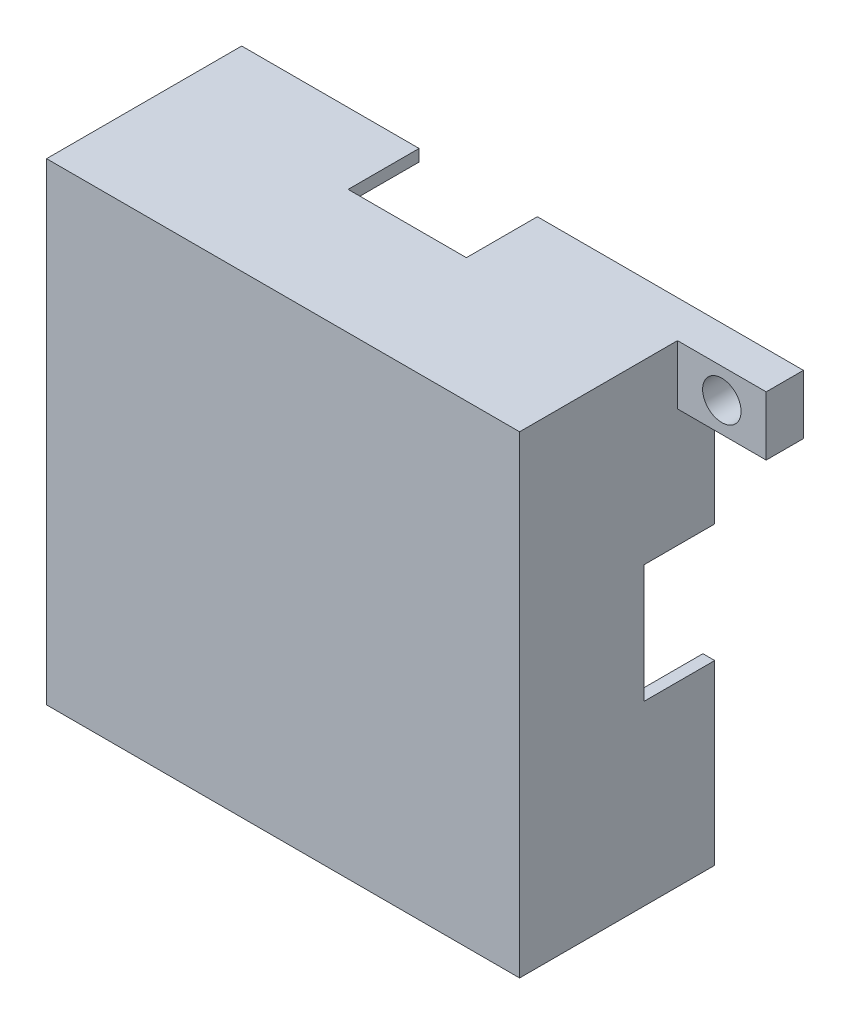
ISO-10303-21;
HEADER;
FILE_DESCRIPTION(('STEP AP214'),'2;1');
FILE_NAME('part.step','',(''),(''),'','','');
FILE_SCHEMA(('AUTOMOTIVE_DESIGN { 1 0 10303 214 1 1 1 1 }'));
ENDSEC;
DATA;
#1=APPLICATION_CONTEXT('core data for automotive mechanical design processes');
#2=APPLICATION_PROTOCOL_DEFINITION('international standard','automotive_design',2000,#1);
#3=PRODUCT_CONTEXT('',#1,'mechanical');
#4=PRODUCT('Part','Part','',(#3));
#5=PRODUCT_RELATED_PRODUCT_CATEGORY('part','',(#4));
#6=PRODUCT_DEFINITION_FORMATION('','',#4);
#7=PRODUCT_DEFINITION_CONTEXT('part definition',#1,'design');
#8=PRODUCT_DEFINITION('design','',#6,#7);
#9=PRODUCT_DEFINITION_SHAPE('','',#8);
#10=(LENGTH_UNIT() NAMED_UNIT(*) SI_UNIT(.MILLI.,.METRE.));
#11=(NAMED_UNIT(*) PLANE_ANGLE_UNIT() SI_UNIT($,.RADIAN.));
#12=(NAMED_UNIT(*) SI_UNIT($,.STERADIAN.) SOLID_ANGLE_UNIT());
#13=UNCERTAINTY_MEASURE_WITH_UNIT(LENGTH_MEASURE(1.E-05),#10,'distance_accuracy_value','');
#14=(GEOMETRIC_REPRESENTATION_CONTEXT(3) GLOBAL_UNCERTAINTY_ASSIGNED_CONTEXT((#13)) GLOBAL_UNIT_ASSIGNED_CONTEXT((#10,
#11,#12)) REPRESENTATION_CONTEXT('',''));
#15=CARTESIAN_POINT('',(0.,0.,0.));
#16=DIRECTION('',(0.,0.,1.));
#17=DIRECTION('',(1.,0.,0.));
#18=AXIS2_PLACEMENT_3D('',#15,#16,#17);
#19=CARTESIAN_POINT('',(0.,0.,0.));
#20=DIRECTION('',(0.,0.,-1.));
#21=DIRECTION('',(-1.,0.,0.));
#22=AXIS2_PLACEMENT_3D('',#19,#20,#21);
#23=PLANE('',#22);
#24=DIRECTION('',(-1.,0.,0.));
#25=VECTOR('',#24,1.);
#26=CARTESIAN_POINT('',(0.,40.,0.));
#27=LINE('',#26,#25);
#28=CARTESIAN_POINT('',(15.,40.,0.));
#29=VERTEX_POINT('',#28);
#30=CARTESIAN_POINT('',(0.,40.,0.));
#31=VERTEX_POINT('',#30);
#32=EDGE_CURVE('E377',#29,#31,#27,.T.);
#33=ORIENTED_EDGE('',*,*,#32,.F.);
#34=DIRECTION('',(0.,-1.,0.));
#35=VECTOR('',#34,1.);
#36=CARTESIAN_POINT('',(15.,40.,0.));
#37=LINE('',#36,#35);
#38=CARTESIAN_POINT('',(15.,39.,0.));
#39=VERTEX_POINT('',#38);
#40=EDGE_CURVE('E91',#29,#39,#37,.T.);
#41=ORIENTED_EDGE('',*,*,#40,.T.);
#42=DIRECTION('',(-1.,0.,0.));
#43=VECTOR('',#42,1.);
#44=CARTESIAN_POINT('',(1.,39.,0.));
#45=LINE('',#44,#43);
#46=CARTESIAN_POINT('',(1.,39.,0.));
#47=VERTEX_POINT('',#46);
#48=EDGE_CURVE('E360',#39,#47,#45,.T.);
#49=ORIENTED_EDGE('',*,*,#48,.T.);
#50=DIRECTION('',(0.,-1.,0.));
#51=VECTOR('',#50,1.);
#52=CARTESIAN_POINT('',(1.,1.,0.));
#53=LINE('',#52,#51);
#54=CARTESIAN_POINT('',(1.,25.,0.));
#55=VERTEX_POINT('',#54);
#56=EDGE_CURVE('E349',#47,#55,#53,.T.);
#57=ORIENTED_EDGE('',*,*,#56,.T.);
#58=DIRECTION('',(-1.,0.,0.));
#59=VECTOR('',#58,1.);
#60=CARTESIAN_POINT('',(47.5,25.,0.));
#61=LINE('',#60,#59);
#62=CARTESIAN_POINT('',(0.,25.,0.));
#63=VERTEX_POINT('',#62);
#64=EDGE_CURVE('E394',#55,#63,#61,.T.);
#65=ORIENTED_EDGE('',*,*,#64,.T.);
#66=DIRECTION('',(0.,1.,0.));
#67=VECTOR('',#66,1.);
#68=CARTESIAN_POINT('',(0.,0.,0.));
#69=LINE('',#68,#67);
#70=EDGE_CURVE('E113',#31,#63,#69,.F.);
#71=ORIENTED_EDGE('',*,*,#70,.F.);
#72=EDGE_LOOP('',(#33,#41,#49,#57,#65,#71));
#73=FACE_BOUND('',#72,.T.);
#74=ADVANCED_FACE('F41',(#73),#23,.T.);
#75=DIRECTION('',(1.,0.,0.));
#76=VECTOR('',#75,1.);
#77=CARTESIAN_POINT('',(1.,1.,0.));
#78=LINE('',#77,#76);
#79=CARTESIAN_POINT('',(1.,1.,0.));
#80=VERTEX_POINT('',#79);
#81=CARTESIAN_POINT('',(15.,1.,0.));
#82=VERTEX_POINT('',#81);
#83=EDGE_CURVE('E162',#80,#82,#78,.T.);
#84=ORIENTED_EDGE('',*,*,#83,.T.);
#85=CARTESIAN_POINT('',(15.,0.,0.));
#86=VERTEX_POINT('',#85);
#87=EDGE_CURVE('E151',#82,#86,#37,.T.);
#88=ORIENTED_EDGE('',*,*,#87,.T.);
#89=DIRECTION('',(1.,0.,0.));
#90=VECTOR('',#89,1.);
#91=CARTESIAN_POINT('',(0.,0.,0.));
#92=LINE('',#91,#90);
#93=CARTESIAN_POINT('',(0.,0.,0.));
#94=VERTEX_POINT('',#93);
#95=EDGE_CURVE('E115',#94,#86,#92,.T.);
#96=ORIENTED_EDGE('',*,*,#95,.F.);
#97=DIRECTION('',(0.,1.,0.));
#98=VECTOR('',#97,1.);
#99=CARTESIAN_POINT('',(0.,0.,0.));
#100=LINE('',#99,#98);
#101=CARTESIAN_POINT('',(0.,15.,0.));
#102=VERTEX_POINT('',#101);
#103=EDGE_CURVE('E120',#102,#94,#100,.F.);
#104=ORIENTED_EDGE('',*,*,#103,.F.);
#105=DIRECTION('',(-1.,0.,0.));
#106=VECTOR('',#105,1.);
#107=CARTESIAN_POINT('',(47.5,15.,0.));
#108=LINE('',#107,#106);
#109=CARTESIAN_POINT('',(1.,15.,0.));
#110=VERTEX_POINT('',#109);
#111=EDGE_CURVE('E238',#110,#102,#108,.T.);
#112=ORIENTED_EDGE('',*,*,#111,.F.);
#113=EDGE_CURVE('E331',#110,#80,#53,.T.);
#114=ORIENTED_EDGE('',*,*,#113,.T.);
#115=EDGE_LOOP('',(#84,#88,#96,#104,#112,#114));
#116=FACE_BOUND('',#115,.T.);
#117=ADVANCED_FACE('F157',(#116),#23,.T.);
#118=CARTESIAN_POINT('',(0.,0.,15.));
#119=DIRECTION('',(0.,1.,0.));
#120=DIRECTION('',(0.,0.,1.));
#121=AXIS2_PLACEMENT_3D('',#118,#119,#120);
#122=PLANE('',#121);
#123=DIRECTION('',(0.,0.,-1.));
#124=VECTOR('',#123,1.);
#125=CARTESIAN_POINT('',(15.,0.,0.));
#126=LINE('',#125,#124);
#127=CARTESIAN_POINT('',(15.,0.,6.));
#128=VERTEX_POINT('',#127);
#129=EDGE_CURVE('E102',#128,#86,#126,.T.);
#130=ORIENTED_EDGE('',*,*,#129,.F.);
#131=DIRECTION('',(-1.,0.,0.));
#132=VECTOR('',#131,1.);
#133=CARTESIAN_POINT('',(15.,0.,6.));
#134=LINE('',#133,#132);
#135=CARTESIAN_POINT('',(25.,0.,6.));
#136=VERTEX_POINT('',#135);
#137=EDGE_CURVE('E104',#136,#128,#134,.T.);
#138=ORIENTED_EDGE('',*,*,#137,.F.);
#139=DIRECTION('',(0.,0.,1.));
#140=VECTOR('',#139,1.);
#141=CARTESIAN_POINT('',(25.,0.,0.));
#142=LINE('',#141,#140);
#143=CARTESIAN_POINT('',(25.,0.,0.));
#144=VERTEX_POINT('',#143);
#145=EDGE_CURVE('E83',#144,#136,#142,.T.);
#146=ORIENTED_EDGE('',*,*,#145,.F.);
#147=DIRECTION('',(1.,0.,0.));
#148=VECTOR('',#147,1.);
#149=CARTESIAN_POINT('',(0.,0.,0.));
#150=LINE('',#149,#148);
#151=CARTESIAN_POINT('',(40.,0.,0.));
#152=VERTEX_POINT('',#151);
#153=EDGE_CURVE('E44',#144,#152,#150,.T.);
#154=ORIENTED_EDGE('',*,*,#153,.T.);
#155=DIRECTION('',(0.,0.,-1.));
#156=VECTOR('',#155,1.);
#157=CARTESIAN_POINT('',(40.,0.,15.));
#158=LINE('',#157,#156);
#159=CARTESIAN_POINT('',(40.,0.,16.5));
#160=VERTEX_POINT('',#159);
#161=EDGE_CURVE('E133',#160,#152,#158,.T.);
#162=ORIENTED_EDGE('',*,*,#161,.F.);
#163=DIRECTION('',(1.,0.,0.));
#164=VECTOR('',#163,1.);
#165=CARTESIAN_POINT('',(0.,0.,16.5));
#166=LINE('',#165,#164);
#167=CARTESIAN_POINT('',(0.,0.,16.5));
#168=VERTEX_POINT('',#167);
#169=EDGE_CURVE('E169',#168,#160,#166,.T.);
#170=ORIENTED_EDGE('',*,*,#169,.F.);
#171=DIRECTION('',(0.,0.,-1.));
#172=VECTOR('',#171,1.);
#173=CARTESIAN_POINT('',(0.,0.,15.));
#174=LINE('',#173,#172);
#175=EDGE_CURVE('E128',#168,#94,#174,.T.);
#176=ORIENTED_EDGE('',*,*,#175,.T.);
#177=ORIENTED_EDGE('',*,*,#95,.T.);
#178=EDGE_LOOP('',(#130,#138,#146,#154,#162,#170,#176,#177));
#179=FACE_BOUND('',#178,.T.);
#180=ADVANCED_FACE('F99',(#179),#122,.F.);
#181=DIRECTION('',(0.,-1.,0.));
#182=VECTOR('',#181,1.);
#183=CARTESIAN_POINT('',(25.,40.,0.));
#184=LINE('',#183,#182);
#185=CARTESIAN_POINT('',(25.,40.,0.));
#186=VERTEX_POINT('',#185);
#187=CARTESIAN_POINT('',(25.,39.,0.));
#188=VERTEX_POINT('',#187);
#189=EDGE_CURVE('E95',#186,#188,#184,.T.);
#190=ORIENTED_EDGE('',*,*,#189,.F.);
#191=CARTESIAN_POINT('',(47.5,40.,0.));
#192=VERTEX_POINT('',#191);
#193=EDGE_CURVE('E374',#192,#186,#27,.T.);
#194=ORIENTED_EDGE('',*,*,#193,.F.);
#195=DIRECTION('',(0.,-1.,0.));
#196=VECTOR('',#195,1.);
#197=CARTESIAN_POINT('',(47.5,40.,0.));
#198=LINE('',#197,#196);
#199=CARTESIAN_POINT('',(47.5,35.,0.));
#200=VERTEX_POINT('',#199);
#201=EDGE_CURVE('E313',#192,#200,#198,.T.);
#202=ORIENTED_EDGE('',*,*,#201,.T.);
#203=DIRECTION('',(-1.,0.,0.));
#204=VECTOR('',#203,1.);
#205=CARTESIAN_POINT('',(40.,35.,0.));
#206=LINE('',#205,#204);
#207=CARTESIAN_POINT('',(40.,35.,0.));
#208=VERTEX_POINT('',#207);
#209=EDGE_CURVE('E310',#200,#208,#206,.T.);
#210=ORIENTED_EDGE('',*,*,#209,.T.);
#211=DIRECTION('',(0.,1.,0.));
#212=VECTOR('',#211,1.);
#213=CARTESIAN_POINT('',(40.,0.,0.));
#214=LINE('',#213,#212);
#215=CARTESIAN_POINT('',(40.,25.,0.));
#216=VERTEX_POINT('',#215);
#217=EDGE_CURVE('E114',#216,#208,#214,.T.);
#218=ORIENTED_EDGE('',*,*,#217,.F.);
#219=CARTESIAN_POINT('',(39.,25.,0.));
#220=VERTEX_POINT('',#219);
#221=EDGE_CURVE('E400',#216,#220,#61,.T.);
#222=ORIENTED_EDGE('',*,*,#221,.T.);
#223=DIRECTION('',(0.,1.,0.));
#224=VECTOR('',#223,1.);
#225=CARTESIAN_POINT('',(39.,1.,0.));
#226=LINE('',#225,#224);
#227=CARTESIAN_POINT('',(39.,39.,0.));
#228=VERTEX_POINT('',#227);
#229=EDGE_CURVE('E351',#220,#228,#226,.T.);
#230=ORIENTED_EDGE('',*,*,#229,.T.);
#231=EDGE_CURVE('E338',#228,#188,#45,.T.);
#232=ORIENTED_EDGE('',*,*,#231,.T.);
#233=EDGE_LOOP('',(#190,#194,#202,#210,#218,#222,#230,#232));
#234=FACE_BOUND('',#233,.T.);
#235=CARTESIAN_POINT('',(43.75,37.5,0.));
#236=DIRECTION('',(0.,0.,-1.));
#237=DIRECTION('',(-1.,0.,0.));
#238=AXIS2_PLACEMENT_3D('',#235,#236,#237);
#239=CIRCLE('',#238,1.625);
#240=CARTESIAN_POINT('',(42.125,37.5,0.));
#241=VERTEX_POINT('',#240);
#242=EDGE_CURVE('E415',#241,#241,#239,.T.);
#243=ORIENTED_EDGE('',*,*,#242,.F.);
#244=EDGE_LOOP('',(#243));
#245=FACE_BOUND('',#244,.T.);
#246=ADVANCED_FACE('F315',(#234,#245),#23,.T.);
#247=CARTESIAN_POINT('',(0.,0.,15.));
#248=DIRECTION('',(1.,0.,0.));
#249=DIRECTION('',(0.,0.,-1.));
#250=AXIS2_PLACEMENT_3D('',#247,#248,#249);
#251=PLANE('',#250);
#252=DIRECTION('',(0.,0.,1.));
#253=VECTOR('',#252,1.);
#254=CARTESIAN_POINT('',(0.,15.,0.));
#255=LINE('',#254,#253);
#256=CARTESIAN_POINT('',(0.,15.,6.));
#257=VERTEX_POINT('',#256);
#258=EDGE_CURVE('E130',#102,#257,#255,.T.);
#259=ORIENTED_EDGE('',*,*,#258,.F.);
#260=ORIENTED_EDGE('',*,*,#103,.T.);
#261=ORIENTED_EDGE('',*,*,#175,.F.);
#262=DIRECTION('',(0.,-1.,0.));
#263=VECTOR('',#262,1.);
#264=CARTESIAN_POINT('',(0.,40.,16.5));
#265=LINE('',#264,#263);
#266=CARTESIAN_POINT('',(0.,40.,16.5));
#267=VERTEX_POINT('',#266);
#268=EDGE_CURVE('E172',#267,#168,#265,.T.);
#269=ORIENTED_EDGE('',*,*,#268,.F.);
#270=DIRECTION('',(0.,0.,-1.));
#271=VECTOR('',#270,1.);
#272=CARTESIAN_POINT('',(0.,40.,15.));
#273=LINE('',#272,#271);
#274=EDGE_CURVE('E372',#267,#31,#273,.T.);
#275=ORIENTED_EDGE('',*,*,#274,.T.);
#276=ORIENTED_EDGE('',*,*,#70,.T.);
#277=DIRECTION('',(0.,0.,-1.));
#278=VECTOR('',#277,1.);
#279=CARTESIAN_POINT('',(0.,25.,0.));
#280=LINE('',#279,#278);
#281=CARTESIAN_POINT('',(0.,25.,6.));
#282=VERTEX_POINT('',#281);
#283=EDGE_CURVE('E381',#282,#63,#280,.T.);
#284=ORIENTED_EDGE('',*,*,#283,.F.);
#285=DIRECTION('',(0.,1.,0.));
#286=VECTOR('',#285,1.);
#287=CARTESIAN_POINT('',(0.,25.,6.));
#288=LINE('',#287,#286);
#289=EDGE_CURVE('E383',#257,#282,#288,.T.);
#290=ORIENTED_EDGE('',*,*,#289,.F.);
#291=EDGE_LOOP('',(#259,#260,#261,#269,#275,#276,#284,#290));
#292=FACE_BOUND('',#291,.T.);
#293=ADVANCED_FACE('F43',(#292),#251,.F.);
#294=CARTESIAN_POINT('',(40.,0.,15.));
#295=DIRECTION('',(-1.,0.,0.));
#296=DIRECTION('',(0.,0.,1.));
#297=AXIS2_PLACEMENT_3D('',#294,#295,#296);
#298=PLANE('',#297);
#299=DIRECTION('',(0.,1.,0.));
#300=VECTOR('',#299,1.);
#301=CARTESIAN_POINT('',(40.,0.,6.));
#302=LINE('',#301,#300);
#303=CARTESIAN_POINT('',(40.,15.,6.));
#304=VERTEX_POINT('',#303);
#305=CARTESIAN_POINT('',(40.,25.,6.));
#306=VERTEX_POINT('',#305);
#307=EDGE_CURVE('E410',#304,#306,#302,.T.);
#308=ORIENTED_EDGE('',*,*,#307,.T.);
#309=DIRECTION('',(0.,0.,-1.));
#310=VECTOR('',#309,1.);
#311=CARTESIAN_POINT('',(40.,25.,15.));
#312=LINE('',#311,#310);
#313=EDGE_CURVE('E296',#306,#216,#312,.T.);
#314=ORIENTED_EDGE('',*,*,#313,.T.);
#315=ORIENTED_EDGE('',*,*,#217,.T.);
#316=DIRECTION('',(0.,0.,-1.));
#317=VECTOR('',#316,1.);
#318=CARTESIAN_POINT('',(40.,35.,3.15));
#319=LINE('',#318,#317);
#320=CARTESIAN_POINT('',(40.,35.,3.15));
#321=VERTEX_POINT('',#320);
#322=EDGE_CURVE('E300',#321,#208,#319,.T.);
#323=ORIENTED_EDGE('',*,*,#322,.F.);
#324=DIRECTION('',(0.,1.,0.));
#325=VECTOR('',#324,1.);
#326=CARTESIAN_POINT('',(40.,40.,3.15));
#327=LINE('',#326,#325);
#328=CARTESIAN_POINT('',(40.,40.,3.15));
#329=VERTEX_POINT('',#328);
#330=EDGE_CURVE('E314',#321,#329,#327,.T.);
#331=ORIENTED_EDGE('',*,*,#330,.T.);
#332=DIRECTION('',(0.,0.,-1.));
#333=VECTOR('',#332,1.);
#334=CARTESIAN_POINT('',(40.,40.,15.));
#335=LINE('',#334,#333);
#336=CARTESIAN_POINT('',(40.,40.,16.5));
#337=VERTEX_POINT('',#336);
#338=EDGE_CURVE('E138',#337,#329,#335,.T.);
#339=ORIENTED_EDGE('',*,*,#338,.F.);
#340=DIRECTION('',(0.,1.,0.));
#341=VECTOR('',#340,1.);
#342=CARTESIAN_POINT('',(40.,40.,16.5));
#343=LINE('',#342,#341);
#344=EDGE_CURVE('E328',#160,#337,#343,.T.);
#345=ORIENTED_EDGE('',*,*,#344,.F.);
#346=ORIENTED_EDGE('',*,*,#161,.T.);
#347=CARTESIAN_POINT('',(40.,15.,0.));
#348=VERTEX_POINT('',#347);
#349=EDGE_CURVE('E111',#152,#348,#214,.T.);
#350=ORIENTED_EDGE('',*,*,#349,.T.);
#351=DIRECTION('',(0.,0.,1.));
#352=VECTOR('',#351,1.);
#353=CARTESIAN_POINT('',(40.,15.,15.));
#354=LINE('',#353,#352);
#355=EDGE_CURVE('E435',#348,#304,#354,.T.);
#356=ORIENTED_EDGE('',*,*,#355,.T.);
#357=EDGE_LOOP('',(#308,#314,#315,#323,#331,#339,#345,#346,#350,#356));
#358=FACE_BOUND('',#357,.T.);
#359=ADVANCED_FACE('F294',(#358),#298,.F.);
#360=CARTESIAN_POINT('',(25.,1.,0.));
#361=VERTEX_POINT('',#360);
#362=EDGE_CURVE('E85',#361,#144,#184,.T.);
#363=ORIENTED_EDGE('',*,*,#362,.F.);
#364=CARTESIAN_POINT('',(39.,1.,0.));
#365=VERTEX_POINT('',#364);
#366=EDGE_CURVE('E352',#361,#365,#78,.T.);
#367=ORIENTED_EDGE('',*,*,#366,.T.);
#368=CARTESIAN_POINT('',(39.,15.,0.));
#369=VERTEX_POINT('',#368);
#370=EDGE_CURVE('E358',#365,#369,#226,.T.);
#371=ORIENTED_EDGE('',*,*,#370,.T.);
#372=EDGE_CURVE('E462',#348,#369,#108,.T.);
#373=ORIENTED_EDGE('',*,*,#372,.F.);
#374=ORIENTED_EDGE('',*,*,#349,.F.);
#375=ORIENTED_EDGE('',*,*,#153,.F.);
#376=EDGE_LOOP('',(#363,#367,#371,#373,#374,#375));
#377=FACE_BOUND('',#376,.T.);
#378=ADVANCED_FACE('F108',(#377),#23,.T.);
#379=CARTESIAN_POINT('',(0.,40.,15.));
#380=DIRECTION('',(0.,-1.,0.));
#381=DIRECTION('',(0.,0.,-1.));
#382=AXIS2_PLACEMENT_3D('',#379,#380,#381);
#383=PLANE('',#382);
#384=DIRECTION('',(-1.,0.,0.));
#385=VECTOR('',#384,1.);
#386=CARTESIAN_POINT('',(15.,40.,6.));
#387=LINE('',#386,#385);
#388=CARTESIAN_POINT('',(25.,40.,6.));
#389=VERTEX_POINT('',#388);
#390=CARTESIAN_POINT('',(15.,40.,6.));
#391=VERTEX_POINT('',#390);
#392=EDGE_CURVE('E161',#389,#391,#387,.T.);
#393=ORIENTED_EDGE('',*,*,#392,.T.);
#394=DIRECTION('',(0.,0.,-1.));
#395=VECTOR('',#394,1.);
#396=CARTESIAN_POINT('',(15.,40.,0.));
#397=LINE('',#396,#395);
#398=EDGE_CURVE('E141',#391,#29,#397,.T.);
#399=ORIENTED_EDGE('',*,*,#398,.T.);
#400=ORIENTED_EDGE('',*,*,#32,.T.);
#401=ORIENTED_EDGE('',*,*,#274,.F.);
#402=DIRECTION('',(-1.,0.,0.));
#403=VECTOR('',#402,1.);
#404=CARTESIAN_POINT('',(0.,40.,16.5));
#405=LINE('',#404,#403);
#406=EDGE_CURVE('E334',#337,#267,#405,.T.);
#407=ORIENTED_EDGE('',*,*,#406,.F.);
#408=ORIENTED_EDGE('',*,*,#338,.T.);
#409=DIRECTION('',(1.,0.,0.));
#410=VECTOR('',#409,1.);
#411=CARTESIAN_POINT('',(40.,40.,3.15));
#412=LINE('',#411,#410);
#413=CARTESIAN_POINT('',(47.5,40.,3.15));
#414=VERTEX_POINT('',#413);
#415=EDGE_CURVE('E320',#329,#414,#412,.T.);
#416=ORIENTED_EDGE('',*,*,#415,.T.);
#417=DIRECTION('',(0.,0.,-1.));
#418=VECTOR('',#417,1.);
#419=CARTESIAN_POINT('',(47.5,40.,3.15));
#420=LINE('',#419,#418);
#421=EDGE_CURVE('E321',#414,#192,#420,.T.);
#422=ORIENTED_EDGE('',*,*,#421,.T.);
#423=ORIENTED_EDGE('',*,*,#193,.T.);
#424=DIRECTION('',(0.,0.,1.));
#425=VECTOR('',#424,1.);
#426=CARTESIAN_POINT('',(25.,40.,0.));
#427=LINE('',#426,#425);
#428=EDGE_CURVE('E504',#186,#389,#427,.T.);
#429=ORIENTED_EDGE('',*,*,#428,.T.);
#430=EDGE_LOOP('',(#393,#399,#400,#401,#407,#408,#416,#422,#423,#429));
#431=FACE_BOUND('',#430,.T.);
#432=ADVANCED_FACE('F426',(#431),#383,.F.);
#433=CARTESIAN_POINT('',(1.,1.,15.));
#434=DIRECTION('',(1.,0.,0.));
#435=DIRECTION('',(0.,0.,-1.));
#436=AXIS2_PLACEMENT_3D('',#433,#434,#435);
#437=PLANE('',#436);
#438=DIRECTION('',(0.,0.,1.));
#439=VECTOR('',#438,1.);
#440=CARTESIAN_POINT('',(1.,25.,15.));
#441=LINE('',#440,#439);
#442=CARTESIAN_POINT('',(1.,25.,6.));
#443=VERTEX_POINT('',#442);
#444=EDGE_CURVE('E406',#55,#443,#441,.T.);
#445=ORIENTED_EDGE('',*,*,#444,.F.);
#446=ORIENTED_EDGE('',*,*,#56,.F.);
#447=DIRECTION('',(0.,0.,-1.));
#448=VECTOR('',#447,1.);
#449=CARTESIAN_POINT('',(1.,39.,15.));
#450=LINE('',#449,#448);
#451=CARTESIAN_POINT('',(1.,39.,15.));
#452=VERTEX_POINT('',#451);
#453=EDGE_CURVE('E348',#452,#47,#450,.T.);
#454=ORIENTED_EDGE('',*,*,#453,.F.);
#455=DIRECTION('',(0.,-1.,0.));
#456=VECTOR('',#455,1.);
#457=CARTESIAN_POINT('',(1.,1.,15.));
#458=LINE('',#457,#456);
#459=CARTESIAN_POINT('',(1.,1.,15.));
#460=VERTEX_POINT('',#459);
#461=EDGE_CURVE('E337',#452,#460,#458,.T.);
#462=ORIENTED_EDGE('',*,*,#461,.T.);
#463=DIRECTION('',(0.,0.,-1.));
#464=VECTOR('',#463,1.);
#465=CARTESIAN_POINT('',(1.,1.,15.));
#466=LINE('',#465,#464);
#467=EDGE_CURVE('E121',#460,#80,#466,.T.);
#468=ORIENTED_EDGE('',*,*,#467,.T.);
#469=ORIENTED_EDGE('',*,*,#113,.F.);
#470=DIRECTION('',(0.,0.,-1.));
#471=VECTOR('',#470,1.);
#472=CARTESIAN_POINT('',(1.,15.,15.));
#473=LINE('',#472,#471);
#474=CARTESIAN_POINT('',(1.,15.,6.));
#475=VERTEX_POINT('',#474);
#476=EDGE_CURVE('E407',#475,#110,#473,.T.);
#477=ORIENTED_EDGE('',*,*,#476,.F.);
#478=DIRECTION('',(0.,-1.,0.));
#479=VECTOR('',#478,1.);
#480=CARTESIAN_POINT('',(1.,1.,6.));
#481=LINE('',#480,#479);
#482=EDGE_CURVE('E449',#443,#475,#481,.T.);
#483=ORIENTED_EDGE('',*,*,#482,.F.);
#484=EDGE_LOOP('',(#445,#446,#454,#462,#468,#469,#477,#483));
#485=FACE_BOUND('',#484,.T.);
#486=ADVANCED_FACE('F443',(#485),#437,.T.);
#487=CARTESIAN_POINT('',(1.,1.,15.));
#488=DIRECTION('',(0.,1.,0.));
#489=DIRECTION('',(0.,0.,1.));
#490=AXIS2_PLACEMENT_3D('',#487,#488,#489);
#491=PLANE('',#490);
#492=DIRECTION('',(0.,0.,1.));
#493=VECTOR('',#492,1.);
#494=CARTESIAN_POINT('',(15.,1.,15.));
#495=LINE('',#494,#493);
#496=CARTESIAN_POINT('',(15.,1.,6.));
#497=VERTEX_POINT('',#496);
#498=EDGE_CURVE('E241',#82,#497,#495,.T.);
#499=ORIENTED_EDGE('',*,*,#498,.F.);
#500=ORIENTED_EDGE('',*,*,#83,.F.);
#501=ORIENTED_EDGE('',*,*,#467,.F.);
#502=DIRECTION('',(1.,0.,0.));
#503=VECTOR('',#502,1.);
#504=CARTESIAN_POINT('',(1.,1.,15.));
#505=LINE('',#504,#503);
#506=CARTESIAN_POINT('',(39.,1.,15.));
#507=VERTEX_POINT('',#506);
#508=EDGE_CURVE('E339',#460,#507,#505,.T.);
#509=ORIENTED_EDGE('',*,*,#508,.T.);
#510=DIRECTION('',(0.,0.,-1.));
#511=VECTOR('',#510,1.);
#512=CARTESIAN_POINT('',(39.,1.,15.));
#513=LINE('',#512,#511);
#514=EDGE_CURVE('E370',#507,#365,#513,.T.);
#515=ORIENTED_EDGE('',*,*,#514,.T.);
#516=ORIENTED_EDGE('',*,*,#366,.F.);
#517=DIRECTION('',(0.,0.,-1.));
#518=VECTOR('',#517,1.);
#519=CARTESIAN_POINT('',(25.,1.,15.));
#520=LINE('',#519,#518);
#521=CARTESIAN_POINT('',(25.,1.,6.));
#522=VERTEX_POINT('',#521);
#523=EDGE_CURVE('E88',#522,#361,#520,.T.);
#524=ORIENTED_EDGE('',*,*,#523,.F.);
#525=DIRECTION('',(1.,0.,0.));
#526=VECTOR('',#525,1.);
#527=CARTESIAN_POINT('',(1.,1.,6.));
#528=LINE('',#527,#526);
#529=EDGE_CURVE('E388',#497,#522,#528,.T.);
#530=ORIENTED_EDGE('',*,*,#529,.F.);
#531=EDGE_LOOP('',(#499,#500,#501,#509,#515,#516,#524,#530));
#532=FACE_BOUND('',#531,.T.);
#533=ADVANCED_FACE('F470',(#532),#491,.T.);
#534=CARTESIAN_POINT('',(39.,1.,15.));
#535=DIRECTION('',(-1.,0.,0.));
#536=DIRECTION('',(0.,0.,1.));
#537=AXIS2_PLACEMENT_3D('',#534,#535,#536);
#538=PLANE('',#537);
#539=DIRECTION('',(0.,0.,-1.));
#540=VECTOR('',#539,1.);
#541=CARTESIAN_POINT('',(39.,25.,15.));
#542=LINE('',#541,#540);
#543=CARTESIAN_POINT('',(39.,25.,6.));
#544=VERTEX_POINT('',#543);
#545=EDGE_CURVE('E136',#544,#220,#542,.T.);
#546=ORIENTED_EDGE('',*,*,#545,.F.);
#547=DIRECTION('',(0.,1.,0.));
#548=VECTOR('',#547,1.);
#549=CARTESIAN_POINT('',(39.,1.,6.));
#550=LINE('',#549,#548);
#551=CARTESIAN_POINT('',(39.,15.,6.));
#552=VERTEX_POINT('',#551);
#553=EDGE_CURVE('E382',#552,#544,#550,.T.);
#554=ORIENTED_EDGE('',*,*,#553,.F.);
#555=DIRECTION('',(0.,0.,1.));
#556=VECTOR('',#555,1.);
#557=CARTESIAN_POINT('',(39.,15.,15.));
#558=LINE('',#557,#556);
#559=EDGE_CURVE('E132',#369,#552,#558,.T.);
#560=ORIENTED_EDGE('',*,*,#559,.F.);
#561=ORIENTED_EDGE('',*,*,#370,.F.);
#562=ORIENTED_EDGE('',*,*,#514,.F.);
#563=DIRECTION('',(0.,1.,0.));
#564=VECTOR('',#563,1.);
#565=CARTESIAN_POINT('',(39.,1.,15.));
#566=LINE('',#565,#564);
#567=CARTESIAN_POINT('',(39.,39.,15.));
#568=VERTEX_POINT('',#567);
#569=EDGE_CURVE('E344',#507,#568,#566,.T.);
#570=ORIENTED_EDGE('',*,*,#569,.T.);
#571=DIRECTION('',(0.,0.,-1.));
#572=VECTOR('',#571,1.);
#573=CARTESIAN_POINT('',(39.,39.,15.));
#574=LINE('',#573,#572);
#575=EDGE_CURVE('E364',#568,#228,#574,.T.);
#576=ORIENTED_EDGE('',*,*,#575,.T.);
#577=ORIENTED_EDGE('',*,*,#229,.F.);
#578=EDGE_LOOP('',(#546,#554,#560,#561,#562,#570,#576,#577));
#579=FACE_BOUND('',#578,.T.);
#580=ADVANCED_FACE('F634',(#579),#538,.T.);
#581=CARTESIAN_POINT('',(1.,39.,15.));
#582=DIRECTION('',(0.,-1.,0.));
#583=DIRECTION('',(0.,0.,-1.));
#584=AXIS2_PLACEMENT_3D('',#581,#582,#583);
#585=PLANE('',#584);
#586=DIRECTION('',(0.,0.,-1.));
#587=VECTOR('',#586,1.);
#588=CARTESIAN_POINT('',(15.,39.,15.));
#589=LINE('',#588,#587);
#590=CARTESIAN_POINT('',(15.,39.,6.));
#591=VERTEX_POINT('',#590);
#592=EDGE_CURVE('E11',#591,#39,#589,.T.);
#593=ORIENTED_EDGE('',*,*,#592,.F.);
#594=DIRECTION('',(-1.,0.,0.));
#595=VECTOR('',#594,1.);
#596=CARTESIAN_POINT('',(1.,39.,6.));
#597=LINE('',#596,#595);
#598=CARTESIAN_POINT('',(25.,39.,6.));
#599=VERTEX_POINT('',#598);
#600=EDGE_CURVE('E51',#599,#591,#597,.T.);
#601=ORIENTED_EDGE('',*,*,#600,.F.);
#602=DIRECTION('',(0.,0.,1.));
#603=VECTOR('',#602,1.);
#604=CARTESIAN_POINT('',(25.,39.,15.));
#605=LINE('',#604,#603);
#606=EDGE_CURVE('E139',#188,#599,#605,.T.);
#607=ORIENTED_EDGE('',*,*,#606,.F.);
#608=ORIENTED_EDGE('',*,*,#231,.F.);
#609=ORIENTED_EDGE('',*,*,#575,.F.);
#610=DIRECTION('',(-1.,0.,0.));
#611=VECTOR('',#610,1.);
#612=CARTESIAN_POINT('',(1.,39.,15.));
#613=LINE('',#612,#611);
#614=EDGE_CURVE('E346',#568,#452,#613,.T.);
#615=ORIENTED_EDGE('',*,*,#614,.T.);
#616=ORIENTED_EDGE('',*,*,#453,.T.);
#617=ORIENTED_EDGE('',*,*,#48,.F.);
#618=EDGE_LOOP('',(#593,#601,#607,#608,#609,#615,#616,#617));
#619=FACE_BOUND('',#618,.T.);
#620=ADVANCED_FACE('F517',(#619),#585,.T.);
#621=CARTESIAN_POINT('',(0.,0.,15.));
#622=DIRECTION('',(0.,0.,1.));
#623=DIRECTION('',(1.,0.,0.));
#624=AXIS2_PLACEMENT_3D('',#621,#622,#623);
#625=PLANE('',#624);
#626=ORIENTED_EDGE('',*,*,#461,.F.);
#627=ORIENTED_EDGE('',*,*,#614,.F.);
#628=ORIENTED_EDGE('',*,*,#569,.F.);
#629=ORIENTED_EDGE('',*,*,#508,.F.);
#630=EDGE_LOOP('',(#626,#627,#628,#629));
#631=FACE_BOUND('',#630,.T.);
#632=ADVANCED_FACE('F627',(#631),#625,.F.);
#633=CARTESIAN_POINT('',(0.,0.,16.5));
#634=DIRECTION('',(0.,0.,1.));
#635=DIRECTION('',(1.,0.,0.));
#636=AXIS2_PLACEMENT_3D('',#633,#634,#635);
#637=PLANE('',#636);
#638=ORIENTED_EDGE('',*,*,#268,.T.);
#639=ORIENTED_EDGE('',*,*,#169,.T.);
#640=ORIENTED_EDGE('',*,*,#344,.T.);
#641=ORIENTED_EDGE('',*,*,#406,.T.);
#642=EDGE_LOOP('',(#638,#639,#640,#641));
#643=FACE_BOUND('',#642,.T.);
#644=ADVANCED_FACE('F427',(#643),#637,.T.);
#645=CARTESIAN_POINT('',(40.,35.,3.15));
#646=DIRECTION('',(0.,-1.,0.));
#647=DIRECTION('',(0.,0.,-1.));
#648=AXIS2_PLACEMENT_3D('',#645,#646,#647);
#649=PLANE('',#648);
#650=ORIENTED_EDGE('',*,*,#209,.F.);
#651=DIRECTION('',(0.,0.,-1.));
#652=VECTOR('',#651,1.);
#653=CARTESIAN_POINT('',(47.5,35.,3.15));
#654=LINE('',#653,#652);
#655=CARTESIAN_POINT('',(47.5,35.,3.15));
#656=VERTEX_POINT('',#655);
#657=EDGE_CURVE('E288',#656,#200,#654,.T.);
#658=ORIENTED_EDGE('',*,*,#657,.F.);
#659=DIRECTION('',(-1.,0.,0.));
#660=VECTOR('',#659,1.);
#661=CARTESIAN_POINT('',(40.,35.,3.15));
#662=LINE('',#661,#660);
#663=EDGE_CURVE('E307',#656,#321,#662,.T.);
#664=ORIENTED_EDGE('',*,*,#663,.T.);
#665=ORIENTED_EDGE('',*,*,#322,.T.);
#666=EDGE_LOOP('',(#650,#658,#664,#665));
#667=FACE_BOUND('',#666,.T.);
#668=ADVANCED_FACE('F306',(#667),#649,.T.);
#669=CARTESIAN_POINT('',(47.5,40.,3.15));
#670=DIRECTION('',(1.,0.,0.));
#671=DIRECTION('',(0.,0.,-1.));
#672=AXIS2_PLACEMENT_3D('',#669,#670,#671);
#673=PLANE('',#672);
#674=ORIENTED_EDGE('',*,*,#201,.F.);
#675=ORIENTED_EDGE('',*,*,#421,.F.);
#676=DIRECTION('',(0.,-1.,0.));
#677=VECTOR('',#676,1.);
#678=CARTESIAN_POINT('',(47.5,40.,3.15));
#679=LINE('',#678,#677);
#680=EDGE_CURVE('E420',#414,#656,#679,.T.);
#681=ORIENTED_EDGE('',*,*,#680,.T.);
#682=ORIENTED_EDGE('',*,*,#657,.T.);
#683=EDGE_LOOP('',(#674,#675,#681,#682));
#684=FACE_BOUND('',#683,.T.);
#685=ADVANCED_FACE('F423',(#684),#673,.T.);
#686=CARTESIAN_POINT('',(0.,0.,3.15));
#687=DIRECTION('',(0.,0.,1.));
#688=DIRECTION('',(1.,0.,0.));
#689=AXIS2_PLACEMENT_3D('',#686,#687,#688);
#690=PLANE('',#689);
#691=CARTESIAN_POINT('',(43.75,37.5,3.15));
#692=DIRECTION('',(0.,0.,-1.));
#693=DIRECTION('',(-1.,0.,0.));
#694=AXIS2_PLACEMENT_3D('',#691,#692,#693);
#695=CIRCLE('',#694,1.625);
#696=CARTESIAN_POINT('',(42.125,37.5,3.15));
#697=VERTEX_POINT('',#696);
#698=EDGE_CURVE('E316',#697,#697,#695,.T.);
#699=ORIENTED_EDGE('',*,*,#698,.T.);
#700=EDGE_LOOP('',(#699));
#701=FACE_BOUND('',#700,.T.);
#702=ORIENTED_EDGE('',*,*,#330,.F.);
#703=ORIENTED_EDGE('',*,*,#663,.F.);
#704=ORIENTED_EDGE('',*,*,#680,.F.);
#705=ORIENTED_EDGE('',*,*,#415,.F.);
#706=EDGE_LOOP('',(#702,#703,#704,#705));
#707=FACE_BOUND('',#706,.T.);
#708=ADVANCED_FACE('F421',(#701,#707),#690,.T.);
#709=CARTESIAN_POINT('',(43.75,37.5,3.15));
#710=DIRECTION('',(0.,0.,-1.));
#711=DIRECTION('',(-1.,0.,0.));
#712=AXIS2_PLACEMENT_3D('',#709,#710,#711);
#713=CYLINDRICAL_SURFACE('',#712,1.625);
#714=ORIENTED_EDGE('',*,*,#698,.F.);
#715=EDGE_LOOP('',(#714));
#716=FACE_BOUND('',#715,.T.);
#717=ORIENTED_EDGE('',*,*,#242,.T.);
#718=EDGE_LOOP('',(#717));
#719=FACE_BOUND('',#718,.T.);
#720=ADVANCED_FACE('F611',(#716,#719),#713,.F.);
#721=CARTESIAN_POINT('',(47.5,15.,0.));
#722=DIRECTION('',(0.,-1.,0.));
#723=DIRECTION('',(0.,0.,-1.));
#724=AXIS2_PLACEMENT_3D('',#721,#722,#723);
#725=PLANE('',#724);
#726=ORIENTED_EDGE('',*,*,#372,.T.);
#727=ORIENTED_EDGE('',*,*,#559,.T.);
#728=DIRECTION('',(-1.,0.,0.));
#729=VECTOR('',#728,1.);
#730=CARTESIAN_POINT('',(47.5,15.,6.));
#731=LINE('',#730,#729);
#732=EDGE_CURVE('E457',#304,#552,#731,.T.);
#733=ORIENTED_EDGE('',*,*,#732,.F.);
#734=ORIENTED_EDGE('',*,*,#355,.F.);
#735=EDGE_LOOP('',(#726,#727,#733,#734));
#736=FACE_BOUND('',#735,.T.);
#737=ADVANCED_FACE('F609',(#736),#725,.F.);
#738=CARTESIAN_POINT('',(47.5,25.,6.));
#739=DIRECTION('',(0.,0.,1.));
#740=DIRECTION('',(1.,0.,0.));
#741=AXIS2_PLACEMENT_3D('',#738,#739,#740);
#742=PLANE('',#741);
#743=ORIENTED_EDGE('',*,*,#732,.T.);
#744=ORIENTED_EDGE('',*,*,#553,.T.);
#745=DIRECTION('',(-1.,0.,0.));
#746=VECTOR('',#745,1.);
#747=CARTESIAN_POINT('',(47.5,25.,6.));
#748=LINE('',#747,#746);
#749=EDGE_CURVE('E396',#306,#544,#748,.T.);
#750=ORIENTED_EDGE('',*,*,#749,.F.);
#751=ORIENTED_EDGE('',*,*,#307,.F.);
#752=EDGE_LOOP('',(#743,#744,#750,#751));
#753=FACE_BOUND('',#752,.T.);
#754=ADVANCED_FACE('F606',(#753),#742,.F.);
#755=CARTESIAN_POINT('',(47.5,25.,0.));
#756=DIRECTION('',(0.,1.,0.));
#757=DIRECTION('',(0.,0.,1.));
#758=AXIS2_PLACEMENT_3D('',#755,#756,#757);
#759=PLANE('',#758);
#760=ORIENTED_EDGE('',*,*,#749,.T.);
#761=ORIENTED_EDGE('',*,*,#545,.T.);
#762=ORIENTED_EDGE('',*,*,#221,.F.);
#763=ORIENTED_EDGE('',*,*,#313,.F.);
#764=EDGE_LOOP('',(#760,#761,#762,#763));
#765=FACE_BOUND('',#764,.T.);
#766=ADVANCED_FACE('F604',(#765),#759,.F.);
#767=ORIENTED_EDGE('',*,*,#444,.T.);
#768=EDGE_CURVE('E451',#443,#282,#748,.T.);
#769=ORIENTED_EDGE('',*,*,#768,.T.);
#770=ORIENTED_EDGE('',*,*,#283,.T.);
#771=ORIENTED_EDGE('',*,*,#64,.F.);
#772=EDGE_LOOP('',(#767,#769,#770,#771));
#773=FACE_BOUND('',#772,.T.);
#774=ADVANCED_FACE('F441',(#773),#759,.F.);
#775=ORIENTED_EDGE('',*,*,#482,.T.);
#776=EDGE_CURVE('E458',#475,#257,#731,.T.);
#777=ORIENTED_EDGE('',*,*,#776,.T.);
#778=ORIENTED_EDGE('',*,*,#289,.T.);
#779=ORIENTED_EDGE('',*,*,#768,.F.);
#780=EDGE_LOOP('',(#775,#777,#778,#779));
#781=FACE_BOUND('',#780,.T.);
#782=ADVANCED_FACE('F614',(#781),#742,.F.);
#783=ORIENTED_EDGE('',*,*,#476,.T.);
#784=ORIENTED_EDGE('',*,*,#111,.T.);
#785=ORIENTED_EDGE('',*,*,#258,.T.);
#786=ORIENTED_EDGE('',*,*,#776,.F.);
#787=EDGE_LOOP('',(#783,#784,#785,#786));
#788=FACE_BOUND('',#787,.T.);
#789=ADVANCED_FACE('F465',(#788),#725,.F.);
#790=CARTESIAN_POINT('',(25.,40.,0.));
#791=DIRECTION('',(1.,0.,0.));
#792=DIRECTION('',(0.,0.,-1.));
#793=AXIS2_PLACEMENT_3D('',#790,#791,#792);
#794=PLANE('',#793);
#795=ORIENTED_EDGE('',*,*,#606,.T.);
#796=DIRECTION('',(0.,-1.,0.));
#797=VECTOR('',#796,1.);
#798=CARTESIAN_POINT('',(25.,40.,6.));
#799=LINE('',#798,#797);
#800=EDGE_CURVE('E498',#389,#599,#799,.T.);
#801=ORIENTED_EDGE('',*,*,#800,.F.);
#802=ORIENTED_EDGE('',*,*,#428,.F.);
#803=ORIENTED_EDGE('',*,*,#189,.T.);
#804=EDGE_LOOP('',(#795,#801,#802,#803));
#805=FACE_BOUND('',#804,.T.);
#806=ADVANCED_FACE('F509',(#805),#794,.F.);
#807=CARTESIAN_POINT('',(15.,40.,6.));
#808=DIRECTION('',(0.,0.,1.));
#809=DIRECTION('',(1.,0.,0.));
#810=AXIS2_PLACEMENT_3D('',#807,#808,#809);
#811=PLANE('',#810);
#812=ORIENTED_EDGE('',*,*,#600,.T.);
#813=DIRECTION('',(0.,-1.,0.));
#814=VECTOR('',#813,1.);
#815=CARTESIAN_POINT('',(15.,40.,6.));
#816=LINE('',#815,#814);
#817=EDGE_CURVE('E505',#391,#591,#816,.T.);
#818=ORIENTED_EDGE('',*,*,#817,.F.);
#819=ORIENTED_EDGE('',*,*,#392,.F.);
#820=ORIENTED_EDGE('',*,*,#800,.T.);
#821=EDGE_LOOP('',(#812,#818,#819,#820));
#822=FACE_BOUND('',#821,.T.);
#823=ADVANCED_FACE('F516',(#822),#811,.F.);
#824=CARTESIAN_POINT('',(15.,40.,0.));
#825=DIRECTION('',(-1.,0.,0.));
#826=DIRECTION('',(0.,0.,1.));
#827=AXIS2_PLACEMENT_3D('',#824,#825,#826);
#828=PLANE('',#827);
#829=ORIENTED_EDGE('',*,*,#592,.T.);
#830=ORIENTED_EDGE('',*,*,#40,.F.);
#831=ORIENTED_EDGE('',*,*,#398,.F.);
#832=ORIENTED_EDGE('',*,*,#817,.T.);
#833=EDGE_LOOP('',(#829,#830,#831,#832));
#834=FACE_BOUND('',#833,.T.);
#835=ADVANCED_FACE('F488',(#834),#828,.F.);
#836=ORIENTED_EDGE('',*,*,#498,.T.);
#837=EDGE_CURVE('E153',#497,#128,#816,.T.);
#838=ORIENTED_EDGE('',*,*,#837,.T.);
#839=ORIENTED_EDGE('',*,*,#129,.T.);
#840=ORIENTED_EDGE('',*,*,#87,.F.);
#841=EDGE_LOOP('',(#836,#838,#839,#840));
#842=FACE_BOUND('',#841,.T.);
#843=ADVANCED_FACE('F146',(#842),#828,.F.);
#844=ORIENTED_EDGE('',*,*,#529,.T.);
#845=EDGE_CURVE('E58',#522,#136,#799,.T.);
#846=ORIENTED_EDGE('',*,*,#845,.T.);
#847=ORIENTED_EDGE('',*,*,#137,.T.);
#848=ORIENTED_EDGE('',*,*,#837,.F.);
#849=EDGE_LOOP('',(#844,#846,#847,#848));
#850=FACE_BOUND('',#849,.T.);
#851=ADVANCED_FACE('F525',(#850),#811,.F.);
#852=ORIENTED_EDGE('',*,*,#523,.T.);
#853=ORIENTED_EDGE('',*,*,#362,.T.);
#854=ORIENTED_EDGE('',*,*,#145,.T.);
#855=ORIENTED_EDGE('',*,*,#845,.F.);
#856=EDGE_LOOP('',(#852,#853,#854,#855));
#857=FACE_BOUND('',#856,.T.);
#858=ADVANCED_FACE('F81',(#857),#794,.F.);
#859=CLOSED_SHELL('',(#74,#117,#180,#246,#293,#359,#378,#432,#486,#533,#580,#620,#632,#644,#668,
#685,#708,#720,#737,#754,#766,#774,#782,#789,#806,#823,#835,#843,#851,#858));
#860=MANIFOLD_SOLID_BREP('B2',#859);
#861=ADVANCED_BREP_SHAPE_REPRESENTATION('',(#18,#860),#14);
#862=SHAPE_DEFINITION_REPRESENTATION(#9,#861);
ENDSEC;
END-ISO-10303-21;
